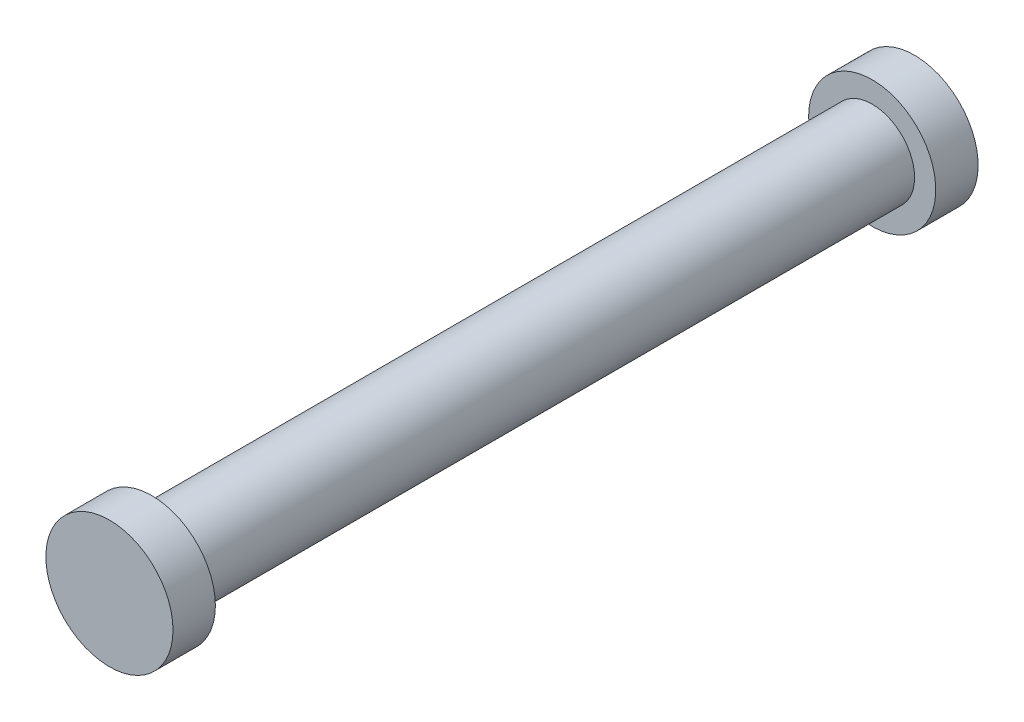
ISO-10303-21;
HEADER;
FILE_DESCRIPTION(('STEP AP214'),'2;1');
FILE_NAME('part.step','',(''),(''),'','','');
FILE_SCHEMA(('AUTOMOTIVE_DESIGN { 1 0 10303 214 1 1 1 1 }'));
ENDSEC;
DATA;
#1=APPLICATION_CONTEXT('core data for automotive mechanical design processes');
#2=APPLICATION_PROTOCOL_DEFINITION('international standard','automotive_design',2000,#1);
#3=PRODUCT_CONTEXT('',#1,'mechanical');
#4=PRODUCT('Part','Part','',(#3));
#5=PRODUCT_RELATED_PRODUCT_CATEGORY('part','',(#4));
#6=PRODUCT_DEFINITION_FORMATION('','',#4);
#7=PRODUCT_DEFINITION_CONTEXT('part definition',#1,'design');
#8=PRODUCT_DEFINITION('design','',#6,#7);
#9=PRODUCT_DEFINITION_SHAPE('','',#8);
#10=(LENGTH_UNIT() NAMED_UNIT(*) SI_UNIT(.MILLI.,.METRE.));
#11=(NAMED_UNIT(*) PLANE_ANGLE_UNIT() SI_UNIT($,.RADIAN.));
#12=(NAMED_UNIT(*) SI_UNIT($,.STERADIAN.) SOLID_ANGLE_UNIT());
#13=UNCERTAINTY_MEASURE_WITH_UNIT(LENGTH_MEASURE(1.E-05),#10,'distance_accuracy_value','');
#14=(GEOMETRIC_REPRESENTATION_CONTEXT(3) GLOBAL_UNCERTAINTY_ASSIGNED_CONTEXT((#13)) GLOBAL_UNIT_ASSIGNED_CONTEXT((#10,
#11,#12)) REPRESENTATION_CONTEXT('',''));
#15=CARTESIAN_POINT('',(0.,0.,0.));
#16=DIRECTION('',(0.,0.,1.));
#17=DIRECTION('',(1.,0.,0.));
#18=AXIS2_PLACEMENT_3D('',#15,#16,#17);
#19=CARTESIAN_POINT('',(0.,0.,34.));
#20=DIRECTION('',(0.,0.,-1.));
#21=DIRECTION('',(-1.,0.,0.));
#22=AXIS2_PLACEMENT_3D('',#19,#20,#21);
#23=CYLINDRICAL_SURFACE('',#22,2.);
#24=CARTESIAN_POINT('',(0.,0.,34.));
#25=DIRECTION('',(0.,0.,1.));
#26=DIRECTION('',(1.,0.,0.));
#27=AXIS2_PLACEMENT_3D('',#24,#25,#26);
#28=CIRCLE('',#27,2.);
#29=CARTESIAN_POINT('',(2.,0.,34.));
#30=VERTEX_POINT('',#29);
#31=EDGE_CURVE('E10',#30,#30,#28,.T.);
#32=ORIENTED_EDGE('',*,*,#31,.F.);
#33=EDGE_LOOP('',(#32));
#34=FACE_BOUND('',#33,.T.);
#35=CARTESIAN_POINT('',(0.,0.,0.));
#36=DIRECTION('',(0.,0.,1.));
#37=DIRECTION('',(1.,0.,0.));
#38=AXIS2_PLACEMENT_3D('',#35,#36,#37);
#39=CIRCLE('',#38,2.);
#40=CARTESIAN_POINT('',(2.,0.,0.));
#41=VERTEX_POINT('',#40);
#42=EDGE_CURVE('E38',#41,#41,#39,.T.);
#43=ORIENTED_EDGE('',*,*,#42,.T.);
#44=EDGE_LOOP('',(#43));
#45=FACE_BOUND('',#44,.T.);
#46=ADVANCED_FACE('F35',(#34,#45),#23,.T.);
#47=CARTESIAN_POINT('',(0.,0.,36.));
#48=DIRECTION('',(0.,0.,-1.));
#49=DIRECTION('',(-1.,0.,0.));
#50=AXIS2_PLACEMENT_3D('',#47,#48,#49);
#51=CYLINDRICAL_SURFACE('',#50,3.);
#52=CARTESIAN_POINT('',(0.,0.,36.));
#53=DIRECTION('',(0.,0.,1.));
#54=DIRECTION('',(1.,0.,0.));
#55=AXIS2_PLACEMENT_3D('',#52,#53,#54);
#56=CIRCLE('',#55,3.);
#57=CARTESIAN_POINT('',(3.,0.,36.));
#58=VERTEX_POINT('',#57);
#59=EDGE_CURVE('E42',#58,#58,#56,.T.);
#60=ORIENTED_EDGE('',*,*,#59,.F.);
#61=EDGE_LOOP('',(#60));
#62=FACE_BOUND('',#61,.T.);
#63=CARTESIAN_POINT('',(0.,0.,34.));
#64=DIRECTION('',(0.,0.,1.));
#65=DIRECTION('',(1.,0.,0.));
#66=AXIS2_PLACEMENT_3D('',#63,#64,#65);
#67=CIRCLE('',#66,3.);
#68=CARTESIAN_POINT('',(3.,0.,34.));
#69=VERTEX_POINT('',#68);
#70=EDGE_CURVE('E46',#69,#69,#67,.T.);
#71=ORIENTED_EDGE('',*,*,#70,.T.);
#72=EDGE_LOOP('',(#71));
#73=FACE_BOUND('',#72,.T.);
#74=ADVANCED_FACE('F83',(#62,#73),#51,.T.);
#75=CARTESIAN_POINT('',(0.,0.,36.));
#76=DIRECTION('',(0.,0.,1.));
#77=DIRECTION('',(1.,0.,0.));
#78=AXIS2_PLACEMENT_3D('',#75,#76,#77);
#79=PLANE('',#78);
#80=ORIENTED_EDGE('',*,*,#59,.T.);
#81=EDGE_LOOP('',(#80));
#82=FACE_BOUND('',#81,.T.);
#83=ADVANCED_FACE('F79',(#82),#79,.T.);
#84=CARTESIAN_POINT('',(0.,0.,34.));
#85=DIRECTION('',(0.,0.,1.));
#86=DIRECTION('',(1.,0.,0.));
#87=AXIS2_PLACEMENT_3D('',#84,#85,#86);
#88=PLANE('',#87);
#89=ORIENTED_EDGE('',*,*,#31,.T.);
#90=EDGE_LOOP('',(#89));
#91=FACE_BOUND('',#90,.T.);
#92=ORIENTED_EDGE('',*,*,#70,.F.);
#93=EDGE_LOOP('',(#92));
#94=FACE_BOUND('',#93,.T.);
#95=ADVANCED_FACE('F71',(#91,#94),#88,.F.);
#96=CARTESIAN_POINT('',(0.,0.,-2.));
#97=DIRECTION('',(0.,0.,1.));
#98=DIRECTION('',(1.,0.,0.));
#99=AXIS2_PLACEMENT_3D('',#96,#97,#98);
#100=CYLINDRICAL_SURFACE('',#99,3.);
#101=CARTESIAN_POINT('',(0.,0.,-2.));
#102=DIRECTION('',(0.,0.,-1.));
#103=DIRECTION('',(-1.,0.,0.));
#104=AXIS2_PLACEMENT_3D('',#101,#102,#103);
#105=CIRCLE('',#104,3.);
#106=CARTESIAN_POINT('',(-3.,0.,-2.));
#107=VERTEX_POINT('',#106);
#108=EDGE_CURVE('E54',#107,#107,#105,.T.);
#109=ORIENTED_EDGE('',*,*,#108,.F.);
#110=EDGE_LOOP('',(#109));
#111=FACE_BOUND('',#110,.T.);
#112=CARTESIAN_POINT('',(0.,0.,0.));
#113=DIRECTION('',(0.,0.,-1.));
#114=DIRECTION('',(-1.,0.,0.));
#115=AXIS2_PLACEMENT_3D('',#112,#113,#114);
#116=CIRCLE('',#115,3.);
#117=CARTESIAN_POINT('',(-3.,0.,0.));
#118=VERTEX_POINT('',#117);
#119=EDGE_CURVE('E51',#118,#118,#116,.T.);
#120=ORIENTED_EDGE('',*,*,#119,.T.);
#121=EDGE_LOOP('',(#120));
#122=FACE_BOUND('',#121,.T.);
#123=ADVANCED_FACE('F69',(#111,#122),#100,.T.);
#124=CARTESIAN_POINT('',(0.,0.,-2.));
#125=DIRECTION('',(0.,0.,-1.));
#126=DIRECTION('',(-1.,0.,0.));
#127=AXIS2_PLACEMENT_3D('',#124,#125,#126);
#128=PLANE('',#127);
#129=ORIENTED_EDGE('',*,*,#108,.T.);
#130=EDGE_LOOP('',(#129));
#131=FACE_BOUND('',#130,.T.);
#132=ADVANCED_FACE('F65',(#131),#128,.T.);
#133=CARTESIAN_POINT('',(0.,0.,0.));
#134=DIRECTION('',(0.,0.,-1.));
#135=DIRECTION('',(-1.,0.,0.));
#136=AXIS2_PLACEMENT_3D('',#133,#134,#135);
#137=PLANE('',#136);
#138=ORIENTED_EDGE('',*,*,#42,.F.);
#139=EDGE_LOOP('',(#138));
#140=FACE_BOUND('',#139,.T.);
#141=ORIENTED_EDGE('',*,*,#119,.F.);
#142=EDGE_LOOP('',(#141));
#143=FACE_BOUND('',#142,.T.);
#144=ADVANCED_FACE('F62',(#140,#143),#137,.F.);
#145=CLOSED_SHELL('',(#46,#74,#83,#95,#123,#132,#144));
#146=MANIFOLD_SOLID_BREP('B2',#145);
#147=ADVANCED_BREP_SHAPE_REPRESENTATION('',(#18,#146),#14);
#148=SHAPE_DEFINITION_REPRESENTATION(#9,#147);
ENDSEC;
END-ISO-10303-21;
